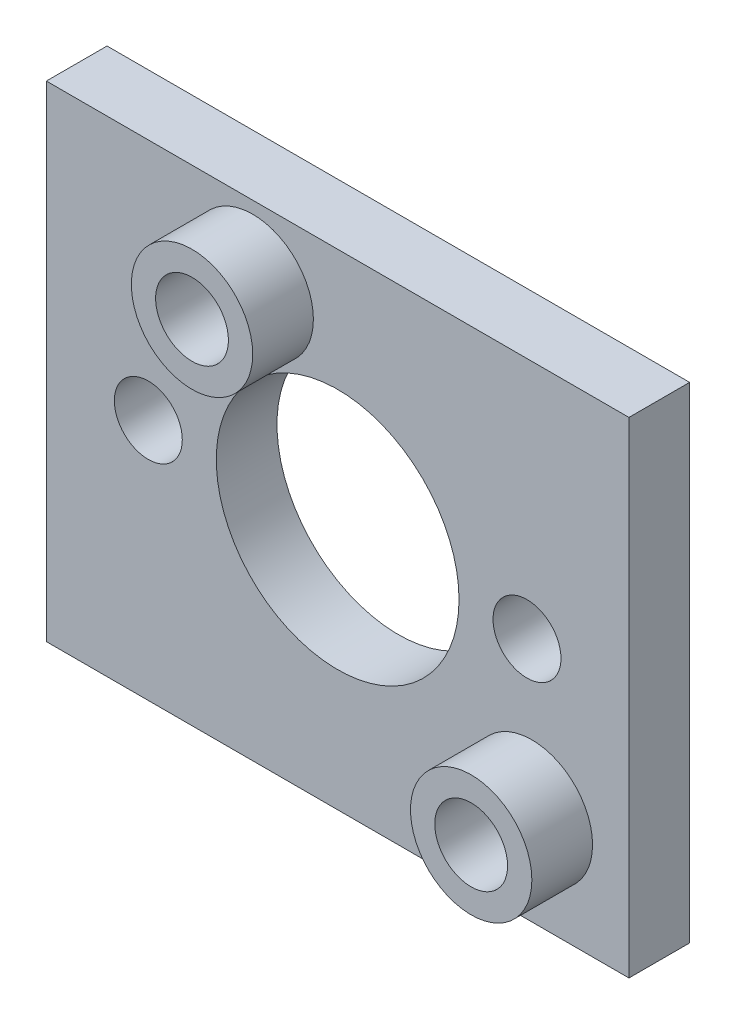
ISO-10303-21;
HEADER;
FILE_DESCRIPTION(('STEP AP214'),'2;1');
FILE_NAME('part.step','',(''),(''),'','','');
FILE_SCHEMA(('AUTOMOTIVE_DESIGN { 1 0 10303 214 1 1 1 1 }'));
ENDSEC;
DATA;
#1=APPLICATION_CONTEXT('core data for automotive mechanical design processes');
#2=APPLICATION_PROTOCOL_DEFINITION('international standard','automotive_design',2000,#1);
#3=PRODUCT_CONTEXT('',#1,'mechanical');
#4=PRODUCT('Part','Part','',(#3));
#5=PRODUCT_RELATED_PRODUCT_CATEGORY('part','',(#4));
#6=PRODUCT_DEFINITION_FORMATION('','',#4);
#7=PRODUCT_DEFINITION_CONTEXT('part definition',#1,'design');
#8=PRODUCT_DEFINITION('design','',#6,#7);
#9=PRODUCT_DEFINITION_SHAPE('','',#8);
#10=(LENGTH_UNIT() NAMED_UNIT(*) SI_UNIT(.MILLI.,.METRE.));
#11=(NAMED_UNIT(*) PLANE_ANGLE_UNIT() SI_UNIT($,.RADIAN.));
#12=(NAMED_UNIT(*) SI_UNIT($,.STERADIAN.) SOLID_ANGLE_UNIT());
#13=UNCERTAINTY_MEASURE_WITH_UNIT(LENGTH_MEASURE(1.E-05),#10,'distance_accuracy_value','');
#14=(GEOMETRIC_REPRESENTATION_CONTEXT(3) GLOBAL_UNCERTAINTY_ASSIGNED_CONTEXT((#13)) GLOBAL_UNIT_ASSIGNED_CONTEXT((#10,
#11,#12)) REPRESENTATION_CONTEXT('',''));
#15=CARTESIAN_POINT('',(0.,0.,0.));
#16=DIRECTION('',(0.,0.,1.));
#17=DIRECTION('',(1.,0.,0.));
#18=AXIS2_PLACEMENT_3D('',#15,#16,#17);
#19=CARTESIAN_POINT('',(0.,0.,3.175));
#20=DIRECTION('',(0.,0.,1.));
#21=DIRECTION('',(1.,0.,0.));
#22=AXIS2_PLACEMENT_3D('',#19,#20,#21);
#23=PLANE('',#22);
#24=CARTESIAN_POINT('',(10.16,-7.62,3.175));
#25=DIRECTION('',(0.,0.,1.));
#26=DIRECTION('',(1.,0.,0.));
#27=AXIS2_PLACEMENT_3D('',#24,#25,#26);
#28=CIRCLE('',#27,3.175);
#29=CARTESIAN_POINT('',(13.335,-7.62,3.175));
#30=VERTEX_POINT('',#29);
#31=EDGE_CURVE('E235',#30,#30,#28,.T.);
#32=ORIENTED_EDGE('',*,*,#31,.F.);
#33=EDGE_LOOP('',(#32));
#34=FACE_BOUND('',#33,.T.);
#35=CARTESIAN_POINT('',(-4.445,8.89,3.175));
#36=DIRECTION('',(0.,0.,1.));
#37=DIRECTION('',(1.,0.,0.));
#38=AXIS2_PLACEMENT_3D('',#35,#36,#37);
#39=CIRCLE('',#38,3.175);
#40=CARTESIAN_POINT('',(-1.27,8.89,3.175));
#41=VERTEX_POINT('',#40);
#42=EDGE_CURVE('E223',#41,#41,#39,.T.);
#43=ORIENTED_EDGE('',*,*,#42,.F.);
#44=EDGE_LOOP('',(#43));
#45=FACE_BOUND('',#44,.T.);
#46=CARTESIAN_POINT('',(-9.906,0.,3.175));
#47=DIRECTION('',(0.,0.,1.));
#48=DIRECTION('',(1.,0.,0.));
#49=AXIS2_PLACEMENT_3D('',#46,#47,#48);
#50=CIRCLE('',#49,1.778);
#51=CARTESIAN_POINT('',(-8.128,0.,3.175));
#52=VERTEX_POINT('',#51);
#53=EDGE_CURVE('E201',#52,#52,#50,.T.);
#54=ORIENTED_EDGE('',*,*,#53,.F.);
#55=EDGE_LOOP('',(#54));
#56=FACE_BOUND('',#55,.T.);
#57=DIRECTION('',(0.,-1.,0.));
#58=VECTOR('',#57,1.);
#59=CARTESIAN_POINT('',(-15.24,-12.7,3.175));
#60=LINE('',#59,#58);
#61=CARTESIAN_POINT('',(-15.24,12.7,3.175));
#62=VERTEX_POINT('',#61);
#63=CARTESIAN_POINT('',(-15.24,-12.7,3.175));
#64=VERTEX_POINT('',#63);
#65=EDGE_CURVE('E93',#62,#64,#60,.T.);
#66=ORIENTED_EDGE('',*,*,#65,.T.);
#67=DIRECTION('',(1.,0.,0.));
#68=VECTOR('',#67,1.);
#69=CARTESIAN_POINT('',(15.24,-12.7,3.175));
#70=LINE('',#69,#68);
#71=CARTESIAN_POINT('',(15.24,-12.7,3.175));
#72=VERTEX_POINT('',#71);
#73=EDGE_CURVE('E88',#64,#72,#70,.T.);
#74=ORIENTED_EDGE('',*,*,#73,.T.);
#75=DIRECTION('',(0.,1.,0.));
#76=VECTOR('',#75,1.);
#77=CARTESIAN_POINT('',(15.24,-12.7,3.175));
#78=LINE('',#77,#76);
#79=CARTESIAN_POINT('',(15.24,12.7,3.175));
#80=VERTEX_POINT('',#79);
#81=EDGE_CURVE('E91',#72,#80,#78,.T.);
#82=ORIENTED_EDGE('',*,*,#81,.T.);
#83=DIRECTION('',(-1.,0.,0.));
#84=VECTOR('',#83,1.);
#85=CARTESIAN_POINT('',(15.24,12.7,3.175));
#86=LINE('',#85,#84);
#87=EDGE_CURVE('E57',#80,#62,#86,.T.);
#88=ORIENTED_EDGE('',*,*,#87,.T.);
#89=EDGE_LOOP('',(#66,#74,#82,#88));
#90=FACE_BOUND('',#89,.T.);
#91=CARTESIAN_POINT('',(0.,0.,3.175));
#92=DIRECTION('',(0.,0.,1.));
#93=DIRECTION('',(1.,0.,0.));
#94=AXIS2_PLACEMENT_3D('',#91,#92,#93);
#95=CIRCLE('',#94,6.35);
#96=CARTESIAN_POINT('',(6.35,0.,3.175));
#97=VERTEX_POINT('',#96);
#98=EDGE_CURVE('E116',#97,#97,#95,.T.);
#99=ORIENTED_EDGE('',*,*,#98,.F.);
#100=EDGE_LOOP('',(#99));
#101=FACE_BOUND('',#100,.T.);
#102=CARTESIAN_POINT('',(9.906,0.,3.175));
#103=DIRECTION('',(0.,0.,1.));
#104=DIRECTION('',(1.,0.,0.));
#105=AXIS2_PLACEMENT_3D('',#102,#103,#104);
#106=CIRCLE('',#105,1.778);
#107=CARTESIAN_POINT('',(11.684,0.,3.175));
#108=VERTEX_POINT('',#107);
#109=EDGE_CURVE('E213',#108,#108,#106,.T.);
#110=ORIENTED_EDGE('',*,*,#109,.F.);
#111=EDGE_LOOP('',(#110));
#112=FACE_BOUND('',#111,.T.);
#113=ADVANCED_FACE('F39',(#34,#45,#56,#90,#101,#112),#23,.T.);
#114=CARTESIAN_POINT('',(0.,0.,0.));
#115=DIRECTION('',(0.,0.,1.));
#116=DIRECTION('',(1.,0.,0.));
#117=AXIS2_PLACEMENT_3D('',#114,#115,#116);
#118=PLANE('',#117);
#119=DIRECTION('',(0.,-1.,0.));
#120=VECTOR('',#119,1.);
#121=CARTESIAN_POINT('',(-15.24,-12.7,0.));
#122=LINE('',#121,#120);
#123=CARTESIAN_POINT('',(-15.24,12.7,0.));
#124=VERTEX_POINT('',#123);
#125=CARTESIAN_POINT('',(-15.24,-12.7,0.));
#126=VERTEX_POINT('',#125);
#127=EDGE_CURVE('E112',#124,#126,#122,.T.);
#128=ORIENTED_EDGE('',*,*,#127,.F.);
#129=DIRECTION('',(-1.,0.,0.));
#130=VECTOR('',#129,1.);
#131=CARTESIAN_POINT('',(15.24,12.7,0.));
#132=LINE('',#131,#130);
#133=CARTESIAN_POINT('',(15.24,12.7,0.));
#134=VERTEX_POINT('',#133);
#135=EDGE_CURVE('E80',#134,#124,#132,.T.);
#136=ORIENTED_EDGE('',*,*,#135,.F.);
#137=DIRECTION('',(0.,1.,0.));
#138=VECTOR('',#137,1.);
#139=CARTESIAN_POINT('',(15.24,-12.7,0.));
#140=LINE('',#139,#138);
#141=CARTESIAN_POINT('',(15.24,-12.7,0.));
#142=VERTEX_POINT('',#141);
#143=EDGE_CURVE('E74',#142,#134,#140,.T.);
#144=ORIENTED_EDGE('',*,*,#143,.F.);
#145=DIRECTION('',(1.,0.,0.));
#146=VECTOR('',#145,1.);
#147=CARTESIAN_POINT('',(15.24,-12.7,0.));
#148=LINE('',#147,#146);
#149=EDGE_CURVE('E99',#126,#142,#148,.T.);
#150=ORIENTED_EDGE('',*,*,#149,.F.);
#151=EDGE_LOOP('',(#128,#136,#144,#150));
#152=FACE_BOUND('',#151,.T.);
#153=CARTESIAN_POINT('',(0.,0.,0.));
#154=DIRECTION('',(0.,0.,1.));
#155=DIRECTION('',(1.,0.,0.));
#156=AXIS2_PLACEMENT_3D('',#153,#154,#155);
#157=CIRCLE('',#156,6.35);
#158=CARTESIAN_POINT('',(6.35,0.,0.));
#159=VERTEX_POINT('',#158);
#160=EDGE_CURVE('E198',#159,#159,#157,.T.);
#161=ORIENTED_EDGE('',*,*,#160,.T.);
#162=EDGE_LOOP('',(#161));
#163=FACE_BOUND('',#162,.T.);
#164=CARTESIAN_POINT('',(-9.906,0.,0.));
#165=DIRECTION('',(0.,0.,1.));
#166=DIRECTION('',(1.,0.,0.));
#167=AXIS2_PLACEMENT_3D('',#164,#165,#166);
#168=CIRCLE('',#167,1.778);
#169=CARTESIAN_POINT('',(-8.128,0.,0.));
#170=VERTEX_POINT('',#169);
#171=EDGE_CURVE('E207',#170,#170,#168,.T.);
#172=ORIENTED_EDGE('',*,*,#171,.T.);
#173=EDGE_LOOP('',(#172));
#174=FACE_BOUND('',#173,.T.);
#175=CARTESIAN_POINT('',(9.906,0.,0.));
#176=DIRECTION('',(0.,0.,1.));
#177=DIRECTION('',(1.,0.,0.));
#178=AXIS2_PLACEMENT_3D('',#175,#176,#177);
#179=CIRCLE('',#178,1.778);
#180=CARTESIAN_POINT('',(11.684,0.,0.));
#181=VERTEX_POINT('',#180);
#182=EDGE_CURVE('E215',#181,#181,#179,.T.);
#183=ORIENTED_EDGE('',*,*,#182,.T.);
#184=EDGE_LOOP('',(#183));
#185=FACE_BOUND('',#184,.T.);
#186=ADVANCED_FACE('F152',(#152,#163,#174,#185),#118,.F.);
#187=CARTESIAN_POINT('',(-15.24,-12.7,3.175));
#188=DIRECTION('',(1.,0.,0.));
#189=DIRECTION('',(0.,0.,-1.));
#190=AXIS2_PLACEMENT_3D('',#187,#188,#189);
#191=PLANE('',#190);
#192=ORIENTED_EDGE('',*,*,#127,.T.);
#193=DIRECTION('',(0.,0.,-1.));
#194=VECTOR('',#193,1.);
#195=CARTESIAN_POINT('',(-15.24,-12.7,3.175));
#196=LINE('',#195,#194);
#197=EDGE_CURVE('E101',#64,#126,#196,.T.);
#198=ORIENTED_EDGE('',*,*,#197,.F.);
#199=ORIENTED_EDGE('',*,*,#65,.F.);
#200=DIRECTION('',(0.,0.,-1.));
#201=VECTOR('',#200,1.);
#202=CARTESIAN_POINT('',(-15.24,12.7,3.175));
#203=LINE('',#202,#201);
#204=EDGE_CURVE('E108',#62,#124,#203,.T.);
#205=ORIENTED_EDGE('',*,*,#204,.T.);
#206=EDGE_LOOP('',(#192,#198,#199,#205));
#207=FACE_BOUND('',#206,.T.);
#208=ADVANCED_FACE('F41',(#207),#191,.F.);
#209=CARTESIAN_POINT('',(15.24,-12.7,3.175));
#210=DIRECTION('',(0.,1.,0.));
#211=DIRECTION('',(-1.,0.,0.));
#212=AXIS2_PLACEMENT_3D('',#209,#210,#211);
#213=PLANE('',#212);
#214=ORIENTED_EDGE('',*,*,#149,.T.);
#215=DIRECTION('',(0.,0.,-1.));
#216=VECTOR('',#215,1.);
#217=CARTESIAN_POINT('',(15.24,-12.7,3.175));
#218=LINE('',#217,#216);
#219=EDGE_CURVE('E97',#72,#142,#218,.T.);
#220=ORIENTED_EDGE('',*,*,#219,.F.);
#221=ORIENTED_EDGE('',*,*,#73,.F.);
#222=ORIENTED_EDGE('',*,*,#197,.T.);
#223=EDGE_LOOP('',(#214,#220,#221,#222));
#224=FACE_BOUND('',#223,.T.);
#225=ADVANCED_FACE('F98',(#224),#213,.F.);
#226=CARTESIAN_POINT('',(15.24,-12.7,3.175));
#227=DIRECTION('',(-1.,0.,0.));
#228=DIRECTION('',(0.,0.,1.));
#229=AXIS2_PLACEMENT_3D('',#226,#227,#228);
#230=PLANE('',#229);
#231=ORIENTED_EDGE('',*,*,#143,.T.);
#232=DIRECTION('',(0.,0.,-1.));
#233=VECTOR('',#232,1.);
#234=CARTESIAN_POINT('',(15.24,12.7,3.175));
#235=LINE('',#234,#233);
#236=EDGE_CURVE('E102',#80,#134,#235,.T.);
#237=ORIENTED_EDGE('',*,*,#236,.F.);
#238=ORIENTED_EDGE('',*,*,#81,.F.);
#239=ORIENTED_EDGE('',*,*,#219,.T.);
#240=EDGE_LOOP('',(#231,#237,#238,#239));
#241=FACE_BOUND('',#240,.T.);
#242=ADVANCED_FACE('F104',(#241),#230,.F.);
#243=CARTESIAN_POINT('',(15.24,12.7,3.175));
#244=DIRECTION('',(0.,-1.,0.));
#245=DIRECTION('',(1.,0.,0.));
#246=AXIS2_PLACEMENT_3D('',#243,#244,#245);
#247=PLANE('',#246);
#248=ORIENTED_EDGE('',*,*,#135,.T.);
#249=ORIENTED_EDGE('',*,*,#204,.F.);
#250=ORIENTED_EDGE('',*,*,#87,.F.);
#251=ORIENTED_EDGE('',*,*,#236,.T.);
#252=EDGE_LOOP('',(#248,#249,#250,#251));
#253=FACE_BOUND('',#252,.T.);
#254=ADVANCED_FACE('F187',(#253),#247,.F.);
#255=CARTESIAN_POINT('',(0.,0.,3.175));
#256=DIRECTION('',(0.,0.,-1.));
#257=DIRECTION('',(-1.,0.,0.));
#258=AXIS2_PLACEMENT_3D('',#255,#256,#257);
#259=CYLINDRICAL_SURFACE('',#258,6.35);
#260=ORIENTED_EDGE('',*,*,#98,.T.);
#261=EDGE_LOOP('',(#260));
#262=FACE_BOUND('',#261,.T.);
#263=ORIENTED_EDGE('',*,*,#160,.F.);
#264=EDGE_LOOP('',(#263));
#265=FACE_BOUND('',#264,.T.);
#266=ADVANCED_FACE('F184',(#262,#265),#259,.F.);
#267=CARTESIAN_POINT('',(-9.906,0.,3.175));
#268=DIRECTION('',(0.,0.,-1.));
#269=DIRECTION('',(-1.,0.,0.));
#270=AXIS2_PLACEMENT_3D('',#267,#268,#269);
#271=CYLINDRICAL_SURFACE('',#270,1.778);
#272=ORIENTED_EDGE('',*,*,#53,.T.);
#273=EDGE_LOOP('',(#272));
#274=FACE_BOUND('',#273,.T.);
#275=ORIENTED_EDGE('',*,*,#171,.F.);
#276=EDGE_LOOP('',(#275));
#277=FACE_BOUND('',#276,.T.);
#278=ADVANCED_FACE('F181',(#274,#277),#271,.F.);
#279=CARTESIAN_POINT('',(9.906,0.,3.175));
#280=DIRECTION('',(0.,0.,-1.));
#281=DIRECTION('',(-1.,0.,0.));
#282=AXIS2_PLACEMENT_3D('',#279,#280,#281);
#283=CYLINDRICAL_SURFACE('',#282,1.778);
#284=ORIENTED_EDGE('',*,*,#109,.T.);
#285=EDGE_LOOP('',(#284));
#286=FACE_BOUND('',#285,.T.);
#287=ORIENTED_EDGE('',*,*,#182,.F.);
#288=EDGE_LOOP('',(#287));
#289=FACE_BOUND('',#288,.T.);
#290=ADVANCED_FACE('F174',(#286,#289),#283,.F.);
#291=CARTESIAN_POINT('',(-4.445,8.89,6.35));
#292=DIRECTION('',(0.,0.,1.));
#293=DIRECTION('',(1.,0.,0.));
#294=AXIS2_PLACEMENT_3D('',#291,#292,#293);
#295=PLANE('',#294);
#296=CARTESIAN_POINT('',(-4.445,8.89,6.35));
#297=DIRECTION('',(0.,0.,1.));
#298=DIRECTION('',(1.,0.,0.));
#299=AXIS2_PLACEMENT_3D('',#296,#297,#298);
#300=CIRCLE('',#299,3.175);
#301=CARTESIAN_POINT('',(-1.27,8.89,6.35));
#302=VERTEX_POINT('',#301);
#303=EDGE_CURVE('E219',#302,#302,#300,.T.);
#304=ORIENTED_EDGE('',*,*,#303,.T.);
#305=EDGE_LOOP('',(#304));
#306=FACE_BOUND('',#305,.T.);
#307=CARTESIAN_POINT('',(-4.445,8.89,6.35));
#308=DIRECTION('',(0.,0.,1.));
#309=DIRECTION('',(1.,0.,0.));
#310=AXIS2_PLACEMENT_3D('',#307,#308,#309);
#311=CIRCLE('',#310,1.905);
#312=CARTESIAN_POINT('',(-2.54,8.89,6.35));
#313=VERTEX_POINT('',#312);
#314=EDGE_CURVE('E227',#313,#313,#311,.T.);
#315=ORIENTED_EDGE('',*,*,#314,.F.);
#316=EDGE_LOOP('',(#315));
#317=FACE_BOUND('',#316,.T.);
#318=ADVANCED_FACE('F171',(#306,#317),#295,.T.);
#319=CARTESIAN_POINT('',(-4.445,8.89,6.35));
#320=DIRECTION('',(0.,0.,-1.));
#321=DIRECTION('',(-1.,0.,0.));
#322=AXIS2_PLACEMENT_3D('',#319,#320,#321);
#323=CYLINDRICAL_SURFACE('',#322,3.175);
#324=ORIENTED_EDGE('',*,*,#303,.F.);
#325=EDGE_LOOP('',(#324));
#326=FACE_BOUND('',#325,.T.);
#327=ORIENTED_EDGE('',*,*,#42,.T.);
#328=EDGE_LOOP('',(#327));
#329=FACE_BOUND('',#328,.T.);
#330=ADVANCED_FACE('F146',(#326,#329),#323,.T.);
#331=CARTESIAN_POINT('',(-4.445,8.89,6.35));
#332=DIRECTION('',(0.,0.,-1.));
#333=DIRECTION('',(-1.,0.,0.));
#334=AXIS2_PLACEMENT_3D('',#331,#332,#333);
#335=CYLINDRICAL_SURFACE('',#334,1.905);
#336=ORIENTED_EDGE('',*,*,#314,.T.);
#337=EDGE_LOOP('',(#336));
#338=FACE_BOUND('',#337,.T.);
#339=CARTESIAN_POINT('',(-4.445,8.89,3.175));
#340=DIRECTION('',(0.,0.,1.));
#341=DIRECTION('',(1.,0.,0.));
#342=AXIS2_PLACEMENT_3D('',#339,#340,#341);
#343=CIRCLE('',#342,1.905);
#344=CARTESIAN_POINT('',(-2.54,8.89,3.175));
#345=VERTEX_POINT('',#344);
#346=EDGE_CURVE('E49',#345,#345,#343,.F.);
#347=ORIENTED_EDGE('',*,*,#346,.T.);
#348=EDGE_LOOP('',(#347));
#349=FACE_BOUND('',#348,.T.);
#350=ADVANCED_FACE('F132',(#338,#349),#335,.F.);
#351=ORIENTED_EDGE('',*,*,#346,.F.);
#352=EDGE_LOOP('',(#351));
#353=FACE_BOUND('',#352,.T.);
#354=ADVANCED_FACE('F134',(#353),#23,.T.);
#355=CARTESIAN_POINT('',(10.16,-7.62,6.35));
#356=DIRECTION('',(0.,0.,1.));
#357=DIRECTION('',(1.,0.,0.));
#358=AXIS2_PLACEMENT_3D('',#355,#356,#357);
#359=PLANE('',#358);
#360=CARTESIAN_POINT('',(10.16,-7.62,6.35));
#361=DIRECTION('',(0.,0.,1.));
#362=DIRECTION('',(1.,0.,0.));
#363=AXIS2_PLACEMENT_3D('',#360,#361,#362);
#364=CIRCLE('',#363,3.175);
#365=CARTESIAN_POINT('',(13.335,-7.62,6.35));
#366=VERTEX_POINT('',#365);
#367=EDGE_CURVE('E234',#366,#366,#364,.T.);
#368=ORIENTED_EDGE('',*,*,#367,.T.);
#369=EDGE_LOOP('',(#368));
#370=FACE_BOUND('',#369,.T.);
#371=CARTESIAN_POINT('',(10.16,-7.62,6.35));
#372=DIRECTION('',(0.,0.,1.));
#373=DIRECTION('',(1.,0.,0.));
#374=AXIS2_PLACEMENT_3D('',#371,#372,#373);
#375=CIRCLE('',#374,1.905);
#376=CARTESIAN_POINT('',(12.065,-7.62,6.35));
#377=VERTEX_POINT('',#376);
#378=EDGE_CURVE('E239',#377,#377,#375,.T.);
#379=ORIENTED_EDGE('',*,*,#378,.F.);
#380=EDGE_LOOP('',(#379));
#381=FACE_BOUND('',#380,.T.);
#382=ADVANCED_FACE('F136',(#370,#381),#359,.T.);
#383=CARTESIAN_POINT('',(10.16,-7.62,6.35));
#384=DIRECTION('',(0.,0.,-1.));
#385=DIRECTION('',(-1.,0.,0.));
#386=AXIS2_PLACEMENT_3D('',#383,#384,#385);
#387=CYLINDRICAL_SURFACE('',#386,3.175);
#388=ORIENTED_EDGE('',*,*,#367,.F.);
#389=EDGE_LOOP('',(#388));
#390=FACE_BOUND('',#389,.T.);
#391=ORIENTED_EDGE('',*,*,#31,.T.);
#392=EDGE_LOOP('',(#391));
#393=FACE_BOUND('',#392,.T.);
#394=ADVANCED_FACE('F143',(#390,#393),#387,.T.);
#395=CARTESIAN_POINT('',(10.16,-7.62,6.35));
#396=DIRECTION('',(0.,0.,-1.));
#397=DIRECTION('',(-1.,0.,0.));
#398=AXIS2_PLACEMENT_3D('',#395,#396,#397);
#399=CYLINDRICAL_SURFACE('',#398,1.905);
#400=ORIENTED_EDGE('',*,*,#378,.T.);
#401=EDGE_LOOP('',(#400));
#402=FACE_BOUND('',#401,.T.);
#403=CARTESIAN_POINT('',(10.16,-7.62,3.175));
#404=DIRECTION('',(0.,0.,1.));
#405=DIRECTION('',(1.,0.,0.));
#406=AXIS2_PLACEMENT_3D('',#403,#404,#405);
#407=CIRCLE('',#406,1.905);
#408=CARTESIAN_POINT('',(12.065,-7.62,3.175));
#409=VERTEX_POINT('',#408);
#410=EDGE_CURVE('E11',#409,#409,#407,.F.);
#411=ORIENTED_EDGE('',*,*,#410,.T.);
#412=EDGE_LOOP('',(#411));
#413=FACE_BOUND('',#412,.T.);
#414=ADVANCED_FACE('F155',(#402,#413),#399,.F.);
#415=ORIENTED_EDGE('',*,*,#410,.F.);
#416=EDGE_LOOP('',(#415));
#417=FACE_BOUND('',#416,.T.);
#418=ADVANCED_FACE('F138',(#417),#23,.T.);
#419=CLOSED_SHELL('',(#113,#186,#208,#225,#242,#254,#266,#278,#290,#318,#330,#350,#354,#382,
#394,#414,#418));
#420=MANIFOLD_SOLID_BREP('B2',#419);
#421=ADVANCED_BREP_SHAPE_REPRESENTATION('',(#18,#420),#14);
#422=SHAPE_DEFINITION_REPRESENTATION(#9,#421);
ENDSEC;
END-ISO-10303-21;
